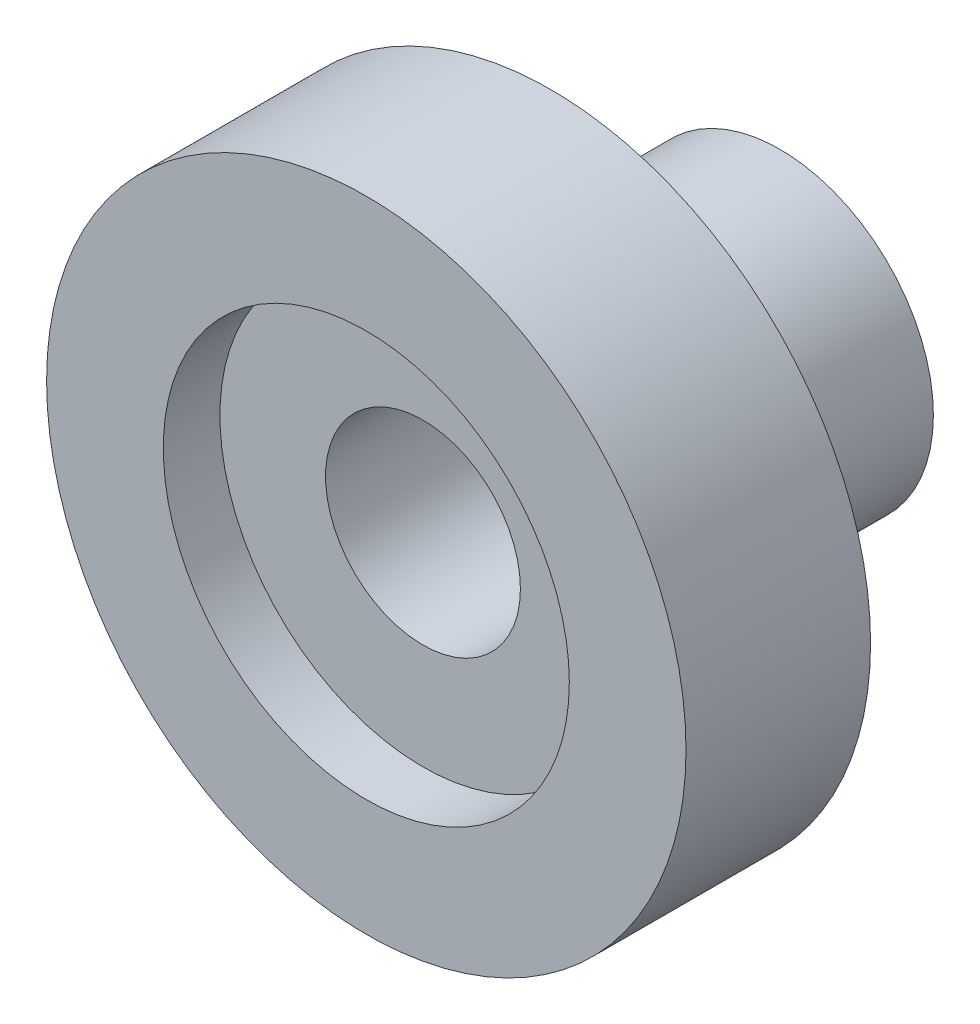
ISO-10303-21;
HEADER;
FILE_DESCRIPTION(('STEP AP214'),'2;1');
FILE_NAME('part.step','',(''),(''),'','','');
FILE_SCHEMA(('AUTOMOTIVE_DESIGN { 1 0 10303 214 1 1 1 1 }'));
ENDSEC;
DATA;
#1=APPLICATION_CONTEXT('core data for automotive mechanical design processes');
#2=APPLICATION_PROTOCOL_DEFINITION('international standard','automotive_design',2000,#1);
#3=PRODUCT_CONTEXT('',#1,'mechanical');
#4=PRODUCT('Part','Part','',(#3));
#5=PRODUCT_RELATED_PRODUCT_CATEGORY('part','',(#4));
#6=PRODUCT_DEFINITION_FORMATION('','',#4);
#7=PRODUCT_DEFINITION_CONTEXT('part definition',#1,'design');
#8=PRODUCT_DEFINITION('design','',#6,#7);
#9=PRODUCT_DEFINITION_SHAPE('','',#8);
#10=(LENGTH_UNIT() NAMED_UNIT(*) SI_UNIT(.MILLI.,.METRE.));
#11=(NAMED_UNIT(*) PLANE_ANGLE_UNIT() SI_UNIT($,.RADIAN.));
#12=(NAMED_UNIT(*) SI_UNIT($,.STERADIAN.) SOLID_ANGLE_UNIT());
#13=UNCERTAINTY_MEASURE_WITH_UNIT(LENGTH_MEASURE(1.E-05),#10,'distance_accuracy_value','');
#14=(GEOMETRIC_REPRESENTATION_CONTEXT(3) GLOBAL_UNCERTAINTY_ASSIGNED_CONTEXT((#13)) GLOBAL_UNIT_ASSIGNED_CONTEXT((#10,
#11,#12)) REPRESENTATION_CONTEXT('',''));
#15=CARTESIAN_POINT('',(0.,0.,0.));
#16=DIRECTION('',(0.,0.,1.));
#17=DIRECTION('',(1.,0.,0.));
#18=AXIS2_PLACEMENT_3D('',#15,#16,#17);
#19=CARTESIAN_POINT('',(0.,0.,8.9568));
#20=DIRECTION('',(0.,0.,1.));
#21=DIRECTION('',(1.,0.,0.));
#22=AXIS2_PLACEMENT_3D('',#19,#20,#21);
#23=CYLINDRICAL_SURFACE('',#22,12.5);
#24=CARTESIAN_POINT('',(0.,0.,8.9568));
#25=DIRECTION('',(0.,0.,-1.));
#26=DIRECTION('',(-1.,0.,0.));
#27=AXIS2_PLACEMENT_3D('',#24,#25,#26);
#28=CIRCLE('',#27,12.5);
#29=CARTESIAN_POINT('',(-12.5,0.,8.9568));
#30=VERTEX_POINT('',#29);
#31=EDGE_CURVE('E48',#30,#30,#28,.T.);
#32=ORIENTED_EDGE('',*,*,#31,.F.);
#33=EDGE_LOOP('',(#32));
#34=FACE_BOUND('',#33,.T.);
#35=CARTESIAN_POINT('',(0.,0.,16.1728));
#36=DIRECTION('',(0.,0.,1.));
#37=DIRECTION('',(1.,0.,0.));
#38=AXIS2_PLACEMENT_3D('',#35,#36,#37);
#39=CIRCLE('',#38,12.5);
#40=CARTESIAN_POINT('',(12.5,0.,16.1728));
#41=VERTEX_POINT('',#40);
#42=EDGE_CURVE('E61',#41,#41,#39,.T.);
#43=ORIENTED_EDGE('',*,*,#42,.F.);
#44=EDGE_LOOP('',(#43));
#45=FACE_BOUND('',#44,.T.);
#46=ADVANCED_FACE('F31',(#34,#45),#23,.T.);
#47=CARTESIAN_POINT('',(0.,0.,17.1728));
#48=DIRECTION('',(0.,0.,-1.));
#49=DIRECTION('',(-1.,0.,0.));
#50=AXIS2_PLACEMENT_3D('',#47,#48,#49);
#51=CYLINDRICAL_SURFACE('',#50,7.9375);
#52=CARTESIAN_POINT('',(0.,0.,13.9568));
#53=DIRECTION('',(0.,0.,1.));
#54=DIRECTION('',(1.,0.,0.));
#55=AXIS2_PLACEMENT_3D('',#52,#53,#54);
#56=CIRCLE('',#55,7.9375);
#57=CARTESIAN_POINT('',(7.9375,0.,13.9568));
#58=VERTEX_POINT('',#57);
#59=EDGE_CURVE('E56',#58,#58,#56,.T.);
#60=ORIENTED_EDGE('',*,*,#59,.F.);
#61=EDGE_LOOP('',(#60));
#62=FACE_BOUND('',#61,.T.);
#63=CARTESIAN_POINT('',(0.,0.,16.1728));
#64=DIRECTION('',(0.,0.,1.));
#65=DIRECTION('',(1.,0.,0.));
#66=AXIS2_PLACEMENT_3D('',#63,#64,#65);
#67=CIRCLE('',#66,7.9375);
#68=CARTESIAN_POINT('',(7.9375,0.,16.1728));
#69=VERTEX_POINT('',#68);
#70=EDGE_CURVE('E35',#69,#69,#67,.T.);
#71=ORIENTED_EDGE('',*,*,#70,.T.);
#72=EDGE_LOOP('',(#71));
#73=FACE_BOUND('',#72,.T.);
#74=ADVANCED_FACE('F68',(#62,#73),#51,.F.);
#75=CARTESIAN_POINT('',(0.,0.,13.9568));
#76=DIRECTION('',(0.,0.,1.));
#77=DIRECTION('',(1.,0.,0.));
#78=AXIS2_PLACEMENT_3D('',#75,#76,#77);
#79=PLANE('',#78);
#80=CARTESIAN_POINT('',(0.,0.,13.9568));
#81=DIRECTION('',(0.,0.,1.));
#82=DIRECTION('',(1.,0.,0.));
#83=AXIS2_PLACEMENT_3D('',#80,#81,#82);
#84=CIRCLE('',#83,3.81);
#85=CARTESIAN_POINT('',(3.81,0.,13.9568));
#86=VERTEX_POINT('',#85);
#87=EDGE_CURVE('E44',#86,#86,#84,.T.);
#88=ORIENTED_EDGE('',*,*,#87,.F.);
#89=EDGE_LOOP('',(#88));
#90=FACE_BOUND('',#89,.T.);
#91=ORIENTED_EDGE('',*,*,#59,.T.);
#92=EDGE_LOOP('',(#91));
#93=FACE_BOUND('',#92,.T.);
#94=ADVANCED_FACE('F88',(#90,#93),#79,.T.);
#95=CARTESIAN_POINT('',(0.,0.,18.9352));
#96=DIRECTION('',(0.,0.,-1.));
#97=DIRECTION('',(-1.,0.,0.));
#98=AXIS2_PLACEMENT_3D('',#95,#96,#97);
#99=CYLINDRICAL_SURFACE('',#98,6.);
#100=CARTESIAN_POINT('',(0.,0.,8.9568));
#101=DIRECTION('',(0.,0.,-1.));
#102=DIRECTION('',(-1.,0.,0.));
#103=AXIS2_PLACEMENT_3D('',#100,#101,#102);
#104=CIRCLE('',#103,6.);
#105=CARTESIAN_POINT('',(-6.,0.,8.9568));
#106=VERTEX_POINT('',#105);
#107=EDGE_CURVE('E52',#106,#106,#104,.T.);
#108=ORIENTED_EDGE('',*,*,#107,.T.);
#109=EDGE_LOOP('',(#108));
#110=FACE_BOUND('',#109,.T.);
#111=CARTESIAN_POINT('',(0.,0.,0.));
#112=DIRECTION('',(0.,0.,1.));
#113=DIRECTION('',(1.,0.,0.));
#114=AXIS2_PLACEMENT_3D('',#111,#112,#113);
#115=CIRCLE('',#114,6.);
#116=CARTESIAN_POINT('',(6.,0.,0.));
#117=VERTEX_POINT('',#116);
#118=EDGE_CURVE('E10',#117,#117,#115,.T.);
#119=ORIENTED_EDGE('',*,*,#118,.T.);
#120=EDGE_LOOP('',(#119));
#121=FACE_BOUND('',#120,.T.);
#122=ADVANCED_FACE('F33',(#110,#121),#99,.T.);
#123=CARTESIAN_POINT('',(0.,0.,18.9352));
#124=DIRECTION('',(0.,0.,-1.));
#125=DIRECTION('',(-1.,0.,0.));
#126=AXIS2_PLACEMENT_3D('',#123,#124,#125);
#127=CYLINDRICAL_SURFACE('',#126,3.81);
#128=CARTESIAN_POINT('',(0.,0.,0.));
#129=DIRECTION('',(0.,0.,1.));
#130=DIRECTION('',(1.,0.,0.));
#131=AXIS2_PLACEMENT_3D('',#128,#129,#130);
#132=CIRCLE('',#131,3.81);
#133=CARTESIAN_POINT('',(3.81,0.,0.));
#134=VERTEX_POINT('',#133);
#135=EDGE_CURVE('E39',#134,#134,#132,.T.);
#136=ORIENTED_EDGE('',*,*,#135,.F.);
#137=EDGE_LOOP('',(#136));
#138=FACE_BOUND('',#137,.T.);
#139=ORIENTED_EDGE('',*,*,#87,.T.);
#140=EDGE_LOOP('',(#139));
#141=FACE_BOUND('',#140,.T.);
#142=ADVANCED_FACE('F95',(#138,#141),#127,.F.);
#143=CARTESIAN_POINT('',(0.,0.,0.));
#144=DIRECTION('',(0.,0.,1.));
#145=DIRECTION('',(1.,0.,0.));
#146=AXIS2_PLACEMENT_3D('',#143,#144,#145);
#147=PLANE('',#146);
#148=ORIENTED_EDGE('',*,*,#118,.F.);
#149=EDGE_LOOP('',(#148));
#150=FACE_BOUND('',#149,.T.);
#151=ORIENTED_EDGE('',*,*,#135,.T.);
#152=EDGE_LOOP('',(#151));
#153=FACE_BOUND('',#152,.T.);
#154=ADVANCED_FACE('F78',(#150,#153),#147,.F.);
#155=CARTESIAN_POINT('',(0.,0.,8.9568));
#156=DIRECTION('',(0.,0.,-1.));
#157=DIRECTION('',(-1.,0.,0.));
#158=AXIS2_PLACEMENT_3D('',#155,#156,#157);
#159=PLANE('',#158);
#160=ORIENTED_EDGE('',*,*,#31,.T.);
#161=EDGE_LOOP('',(#160));
#162=FACE_BOUND('',#161,.T.);
#163=ORIENTED_EDGE('',*,*,#107,.F.);
#164=EDGE_LOOP('',(#163));
#165=FACE_BOUND('',#164,.T.);
#166=ADVANCED_FACE('F72',(#162,#165),#159,.T.);
#167=CARTESIAN_POINT('',(0.,0.,16.1728));
#168=DIRECTION('',(0.,0.,1.));
#169=DIRECTION('',(1.,0.,0.));
#170=AXIS2_PLACEMENT_3D('',#167,#168,#169);
#171=PLANE('',#170);
#172=ORIENTED_EDGE('',*,*,#70,.F.);
#173=EDGE_LOOP('',(#172));
#174=FACE_BOUND('',#173,.T.);
#175=ORIENTED_EDGE('',*,*,#42,.T.);
#176=EDGE_LOOP('',(#175));
#177=FACE_BOUND('',#176,.T.);
#178=ADVANCED_FACE('F70',(#174,#177),#171,.T.);
#179=CLOSED_SHELL('',(#46,#74,#94,#122,#142,#154,#166,#178));
#180=MANIFOLD_SOLID_BREP('B2',#179);
#181=ADVANCED_BREP_SHAPE_REPRESENTATION('',(#18,#180),#14);
#182=SHAPE_DEFINITION_REPRESENTATION(#9,#181);
ENDSEC;
END-ISO-10303-21;
